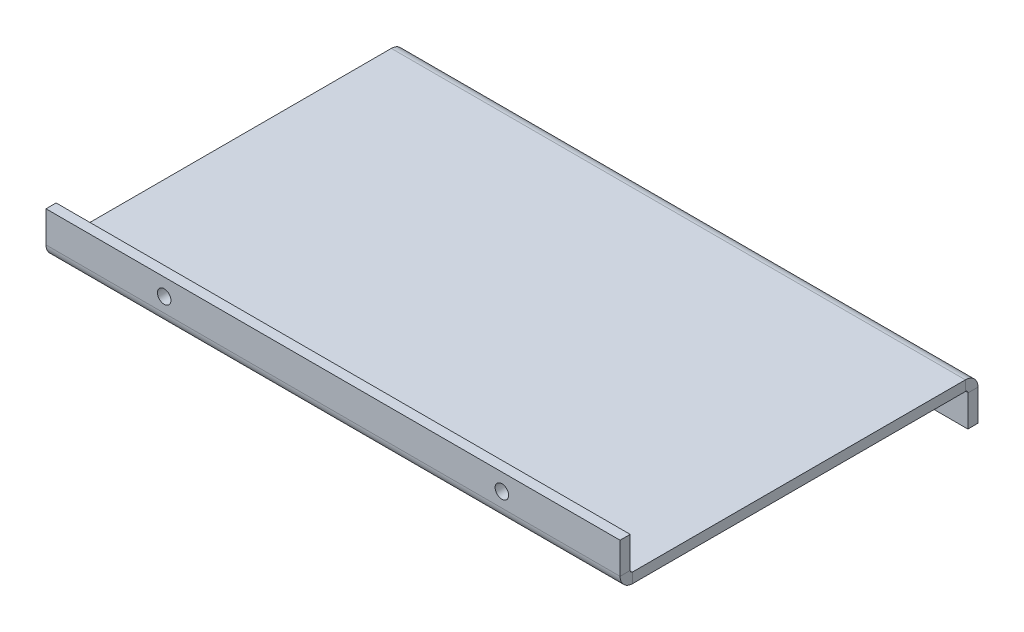
ISO-10303-21;
HEADER;
FILE_DESCRIPTION(('STEP AP214'),'2;1');
FILE_NAME('part.step','',(''),(''),'','','');
FILE_SCHEMA(('AUTOMOTIVE_DESIGN { 1 0 10303 214 1 1 1 1 }'));
ENDSEC;
DATA;
#1=APPLICATION_CONTEXT('core data for automotive mechanical design processes');
#2=APPLICATION_PROTOCOL_DEFINITION('international standard','automotive_design',2000,#1);
#3=PRODUCT_CONTEXT('',#1,'mechanical');
#4=PRODUCT('Part','Part','',(#3));
#5=PRODUCT_RELATED_PRODUCT_CATEGORY('part','',(#4));
#6=PRODUCT_DEFINITION_FORMATION('','',#4);
#7=PRODUCT_DEFINITION_CONTEXT('part definition',#1,'design');
#8=PRODUCT_DEFINITION('design','',#6,#7);
#9=PRODUCT_DEFINITION_SHAPE('','',#8);
#10=(LENGTH_UNIT() NAMED_UNIT(*) SI_UNIT(.MILLI.,.METRE.));
#11=(NAMED_UNIT(*) PLANE_ANGLE_UNIT() SI_UNIT($,.RADIAN.));
#12=(NAMED_UNIT(*) SI_UNIT($,.STERADIAN.) SOLID_ANGLE_UNIT());
#13=UNCERTAINTY_MEASURE_WITH_UNIT(LENGTH_MEASURE(1.E-05),#10,'distance_accuracy_value','');
#14=(GEOMETRIC_REPRESENTATION_CONTEXT(3) GLOBAL_UNCERTAINTY_ASSIGNED_CONTEXT((#13)) GLOBAL_UNIT_ASSIGNED_CONTEXT((#10,
#11,#12)) REPRESENTATION_CONTEXT('',''));
#15=CARTESIAN_POINT('',(0.,0.,0.));
#16=DIRECTION('',(0.,0.,1.));
#17=DIRECTION('',(1.,0.,0.));
#18=AXIS2_PLACEMENT_3D('',#15,#16,#17);
#19=CARTESIAN_POINT('',(85.,-3.,50.));
#20=DIRECTION('',(1.,0.,0.));
#21=DIRECTION('',(0.,0.,-1.));
#22=AXIS2_PLACEMENT_3D('',#19,#20,#21);
#23=PLANE('',#22);
#24=DIRECTION('',(0.,0.,-1.));
#25=VECTOR('',#24,1.);
#26=CARTESIAN_POINT('',(85.,-3.,50.));
#27=LINE('',#26,#25);
#28=CARTESIAN_POINT('',(85.,-3.,49.2634));
#29=VERTEX_POINT('',#28);
#30=CARTESIAN_POINT('',(85.,-3.00000000000001,-49.2634));
#31=VERTEX_POINT('',#30);
#32=EDGE_CURVE('E11',#29,#31,#27,.T.);
#33=ORIENTED_EDGE('',*,*,#32,.T.);
#34=DIRECTION('',(0.,1.,0.));
#35=VECTOR('',#34,1.);
#36=CARTESIAN_POINT('',(85.,-3.00000000000001,-49.2634));
#37=LINE('',#36,#35);
#38=CARTESIAN_POINT('',(85.,0.,-49.2634000000001));
#39=VERTEX_POINT('',#38);
#40=EDGE_CURVE('E201',#31,#39,#37,.T.);
#41=ORIENTED_EDGE('',*,*,#40,.T.);
#42=DIRECTION('',(0.,0.,-1.));
#43=VECTOR('',#42,1.);
#44=CARTESIAN_POINT('',(85.,0.,50.));
#45=LINE('',#44,#43);
#46=CARTESIAN_POINT('',(85.,0.,49.2634));
#47=VERTEX_POINT('',#46);
#48=EDGE_CURVE('E45',#47,#39,#45,.T.);
#49=ORIENTED_EDGE('',*,*,#48,.F.);
#50=DIRECTION('',(0.,-1.,0.));
#51=VECTOR('',#50,1.);
#52=CARTESIAN_POINT('',(85.,0.,49.2634));
#53=LINE('',#52,#51);
#54=EDGE_CURVE('E268',#47,#29,#53,.T.);
#55=ORIENTED_EDGE('',*,*,#54,.T.);
#56=EDGE_LOOP('',(#33,#41,#49,#55));
#57=FACE_BOUND('',#56,.T.);
#58=ADVANCED_FACE('F41',(#57),#23,.T.);
#59=CARTESIAN_POINT('',(0.,-3.,0.));
#60=DIRECTION('',(0.,1.,0.));
#61=DIRECTION('',(0.,0.,1.));
#62=AXIS2_PLACEMENT_3D('',#59,#60,#61);
#63=PLANE('',#62);
#64=DIRECTION('',(1.,0.,0.));
#65=VECTOR('',#64,1.);
#66=CARTESIAN_POINT('',(85.,-3.00000000000001,-49.2634));
#67=LINE('',#66,#65);
#68=CARTESIAN_POINT('',(-85.,-3.00000000000001,-49.2634));
#69=VERTEX_POINT('',#68);
#70=EDGE_CURVE('E206',#31,#69,#67,.F.);
#71=ORIENTED_EDGE('',*,*,#70,.F.);
#72=ORIENTED_EDGE('',*,*,#32,.F.);
#73=DIRECTION('',(1.,0.,0.));
#74=VECTOR('',#73,1.);
#75=CARTESIAN_POINT('',(85.,-3.,49.2634));
#76=LINE('',#75,#74);
#77=CARTESIAN_POINT('',(-84.9999999999999,-3.,49.2634));
#78=VERTEX_POINT('',#77);
#79=EDGE_CURVE('E260',#29,#78,#76,.F.);
#80=ORIENTED_EDGE('',*,*,#79,.T.);
#81=DIRECTION('',(0.,0.,1.));
#82=VECTOR('',#81,1.);
#83=CARTESIAN_POINT('',(-85.,-3.,50.));
#84=LINE('',#83,#82);
#85=EDGE_CURVE('E51',#69,#78,#84,.T.);
#86=ORIENTED_EDGE('',*,*,#85,.F.);
#87=EDGE_LOOP('',(#71,#72,#80,#86));
#88=FACE_BOUND('',#87,.T.);
#89=ADVANCED_FACE('F333',(#88),#63,.F.);
#90=CARTESIAN_POINT('',(0.,0.,0.));
#91=DIRECTION('',(0.,1.,0.));
#92=DIRECTION('',(0.,0.,1.));
#93=AXIS2_PLACEMENT_3D('',#90,#91,#92);
#94=PLANE('',#93);
#95=ORIENTED_EDGE('',*,*,#48,.T.);
#96=DIRECTION('',(1.,0.,0.));
#97=VECTOR('',#96,1.);
#98=CARTESIAN_POINT('',(85.,0.,-49.2634000000001));
#99=LINE('',#98,#97);
#100=CARTESIAN_POINT('',(-85.,0.,-49.2634));
#101=VERTEX_POINT('',#100);
#102=EDGE_CURVE('E141',#39,#101,#99,.F.);
#103=ORIENTED_EDGE('',*,*,#102,.T.);
#104=DIRECTION('',(0.,0.,1.));
#105=VECTOR('',#104,1.);
#106=CARTESIAN_POINT('',(-85.,0.,50.));
#107=LINE('',#106,#105);
#108=CARTESIAN_POINT('',(-84.9999999999999,0.,49.2634));
#109=VERTEX_POINT('',#108);
#110=EDGE_CURVE('E285',#101,#109,#107,.T.);
#111=ORIENTED_EDGE('',*,*,#110,.T.);
#112=DIRECTION('',(1.,0.,0.));
#113=VECTOR('',#112,1.);
#114=CARTESIAN_POINT('',(85.,0.,49.2634));
#115=LINE('',#114,#113);
#116=EDGE_CURVE('E59',#47,#109,#115,.F.);
#117=ORIENTED_EDGE('',*,*,#116,.F.);
#118=EDGE_LOOP('',(#95,#103,#111,#117));
#119=FACE_BOUND('',#118,.T.);
#120=ADVANCED_FACE('F293',(#119),#94,.T.);
#121=CARTESIAN_POINT('',(-85.,-3.,50.));
#122=DIRECTION('',(-1.,0.,0.));
#123=DIRECTION('',(0.,0.,1.));
#124=AXIS2_PLACEMENT_3D('',#121,#122,#123);
#125=PLANE('',#124);
#126=DIRECTION('',(0.,1.,0.));
#127=VECTOR('',#126,1.);
#128=CARTESIAN_POINT('',(-85.,-3.00000000000001,-49.2634));
#129=LINE('',#128,#127);
#130=EDGE_CURVE('E211',#69,#101,#129,.T.);
#131=ORIENTED_EDGE('',*,*,#130,.F.);
#132=ORIENTED_EDGE('',*,*,#85,.T.);
#133=DIRECTION('',(0.,-1.,0.));
#134=VECTOR('',#133,1.);
#135=CARTESIAN_POINT('',(-84.9999999999999,0.,49.2634));
#136=LINE('',#135,#134);
#137=EDGE_CURVE('E281',#109,#78,#136,.T.);
#138=ORIENTED_EDGE('',*,*,#137,.F.);
#139=ORIENTED_EDGE('',*,*,#110,.F.);
#140=EDGE_LOOP('',(#131,#132,#138,#139));
#141=FACE_BOUND('',#140,.T.);
#142=ADVANCED_FACE('F43',(#141),#125,.T.);
#143=CARTESIAN_POINT('',(-85.,0.736599999999993,49.2634));
#144=DIRECTION('',(-1.,0.,0.));
#145=DIRECTION('',(0.,0.,1.));
#146=AXIS2_PLACEMENT_3D('',#143,#144,#145);
#147=PLANE('',#146);
#148=DIRECTION('',(0.,0.,1.));
#149=VECTOR('',#148,1.);
#150=CARTESIAN_POINT('',(-85.,0.736599999999997,50.));
#151=LINE('',#150,#149);
#152=CARTESIAN_POINT('',(-84.9999999999999,0.736599999999993,50.));
#153=VERTEX_POINT('',#152);
#154=CARTESIAN_POINT('',(-84.9999999999999,0.736599999999993,53.));
#155=VERTEX_POINT('',#154);
#156=EDGE_CURVE('E215',#153,#155,#151,.T.);
#157=ORIENTED_EDGE('',*,*,#156,.F.);
#158=CARTESIAN_POINT('',(-85.,0.736599999999993,49.2634));
#159=DIRECTION('',(1.,0.,0.));
#160=DIRECTION('',(0.,0.,-1.));
#161=AXIS2_PLACEMENT_3D('',#158,#159,#160);
#162=CIRCLE('',#161,0.736599999999997);
#163=EDGE_CURVE('E272',#109,#153,#162,.F.);
#164=ORIENTED_EDGE('',*,*,#163,.F.);
#165=ORIENTED_EDGE('',*,*,#137,.T.);
#166=CARTESIAN_POINT('',(-84.9999999999999,0.736599999999993,49.2634));
#167=DIRECTION('',(1.,0.,0.));
#168=DIRECTION('',(0.,0.,-1.));
#169=AXIS2_PLACEMENT_3D('',#166,#167,#168);
#170=CIRCLE('',#169,3.7366);
#171=EDGE_CURVE('E263',#78,#155,#170,.F.);
#172=ORIENTED_EDGE('',*,*,#171,.T.);
#173=EDGE_LOOP('',(#157,#164,#165,#172));
#174=FACE_BOUND('',#173,.T.);
#175=ADVANCED_FACE('F328',(#174),#147,.T.);
#176=CARTESIAN_POINT('',(85.,0.736599999999993,49.2634));
#177=DIRECTION('',(-1.,0.,0.));
#178=DIRECTION('',(0.,0.,1.));
#179=AXIS2_PLACEMENT_3D('',#176,#177,#178);
#180=PLANE('',#179);
#181=CARTESIAN_POINT('',(85.,0.736599999999993,49.2634));
#182=DIRECTION('',(1.,0.,0.));
#183=DIRECTION('',(0.,0.,-1.));
#184=AXIS2_PLACEMENT_3D('',#181,#182,#183);
#185=CIRCLE('',#184,0.736599999999997);
#186=CARTESIAN_POINT('',(85.,0.736599999999993,50.));
#187=VERTEX_POINT('',#186);
#188=EDGE_CURVE('E259',#187,#47,#185,.T.);
#189=ORIENTED_EDGE('',*,*,#188,.F.);
#190=DIRECTION('',(0.,0.,1.));
#191=VECTOR('',#190,1.);
#192=CARTESIAN_POINT('',(85.,0.73659999999999,50.));
#193=LINE('',#192,#191);
#194=CARTESIAN_POINT('',(85.,0.73659999999999,53.));
#195=VERTEX_POINT('',#194);
#196=EDGE_CURVE('E221',#187,#195,#193,.T.);
#197=ORIENTED_EDGE('',*,*,#196,.T.);
#198=CARTESIAN_POINT('',(85.,0.736599999999993,49.2634));
#199=DIRECTION('',(1.,0.,0.));
#200=DIRECTION('',(0.,0.,-1.));
#201=AXIS2_PLACEMENT_3D('',#198,#199,#200);
#202=CIRCLE('',#201,3.7366);
#203=EDGE_CURVE('E264',#195,#29,#202,.T.);
#204=ORIENTED_EDGE('',*,*,#203,.T.);
#205=ORIENTED_EDGE('',*,*,#54,.F.);
#206=EDGE_LOOP('',(#189,#197,#204,#205));
#207=FACE_BOUND('',#206,.T.);
#208=ADVANCED_FACE('F299',(#207),#180,.F.);
#209=CARTESIAN_POINT('',(85.,0.736599999999993,49.2634));
#210=DIRECTION('',(1.,0.,0.));
#211=DIRECTION('',(0.,0.,1.));
#212=AXIS2_PLACEMENT_3D('',#209,#210,#211);
#213=CYLINDRICAL_SURFACE('',#212,3.7366);
#214=ORIENTED_EDGE('',*,*,#79,.F.);
#215=ORIENTED_EDGE('',*,*,#203,.F.);
#216=DIRECTION('',(-1.,0.,0.));
#217=VECTOR('',#216,1.);
#218=CARTESIAN_POINT('',(0.,0.736599999999993,53.));
#219=LINE('',#218,#217);
#220=EDGE_CURVE('E225',#195,#155,#219,.T.);
#221=ORIENTED_EDGE('',*,*,#220,.T.);
#222=ORIENTED_EDGE('',*,*,#171,.F.);
#223=EDGE_LOOP('',(#214,#215,#221,#222));
#224=FACE_BOUND('',#223,.T.);
#225=ADVANCED_FACE('F326',(#224),#213,.T.);
#226=CARTESIAN_POINT('',(85.,0.736599999999993,49.2634));
#227=DIRECTION('',(1.,0.,0.));
#228=DIRECTION('',(0.,0.,1.));
#229=AXIS2_PLACEMENT_3D('',#226,#227,#228);
#230=CYLINDRICAL_SURFACE('',#229,0.736599999999997);
#231=ORIENTED_EDGE('',*,*,#116,.T.);
#232=ORIENTED_EDGE('',*,*,#163,.T.);
#233=DIRECTION('',(1.,0.,0.));
#234=VECTOR('',#233,1.);
#235=CARTESIAN_POINT('',(-85.,0.736599999999997,50.));
#236=LINE('',#235,#234);
#237=EDGE_CURVE('E218',#153,#187,#236,.T.);
#238=ORIENTED_EDGE('',*,*,#237,.T.);
#239=ORIENTED_EDGE('',*,*,#188,.T.);
#240=EDGE_LOOP('',(#231,#232,#238,#239));
#241=FACE_BOUND('',#240,.T.);
#242=ADVANCED_FACE('F302',(#241),#230,.F.);
#243=CARTESIAN_POINT('',(-85.,0.,53.));
#244=DIRECTION('',(1.,0.,0.));
#245=DIRECTION('',(0.,1.,0.));
#246=AXIS2_PLACEMENT_3D('',#243,#244,#245);
#247=PLANE('',#246);
#248=ORIENTED_EDGE('',*,*,#156,.T.);
#249=DIRECTION('',(0.,-1.,0.));
#250=VECTOR('',#249,1.);
#251=CARTESIAN_POINT('',(-85.,0.,53.));
#252=LINE('',#251,#250);
#253=CARTESIAN_POINT('',(-85.,10.,53.));
#254=VERTEX_POINT('',#253);
#255=EDGE_CURVE('E232',#254,#155,#252,.T.);
#256=ORIENTED_EDGE('',*,*,#255,.F.);
#257=DIRECTION('',(0.,0.,-1.));
#258=VECTOR('',#257,1.);
#259=CARTESIAN_POINT('',(-85.,10.,53.));
#260=LINE('',#259,#258);
#261=CARTESIAN_POINT('',(-85.,10.,50.));
#262=VERTEX_POINT('',#261);
#263=EDGE_CURVE('E243',#254,#262,#260,.T.);
#264=ORIENTED_EDGE('',*,*,#263,.T.);
#265=DIRECTION('',(0.,-1.,0.));
#266=VECTOR('',#265,1.);
#267=CARTESIAN_POINT('',(-85.,0.,50.));
#268=LINE('',#267,#266);
#269=EDGE_CURVE('E231',#262,#153,#268,.T.);
#270=ORIENTED_EDGE('',*,*,#269,.T.);
#271=EDGE_LOOP('',(#248,#256,#264,#270));
#272=FACE_BOUND('',#271,.T.);
#273=ADVANCED_FACE('F311',(#272),#247,.F.);
#274=CARTESIAN_POINT('',(85.,10.,53.));
#275=DIRECTION('',(-1.,0.,0.));
#276=DIRECTION('',(0.,-1.,0.));
#277=AXIS2_PLACEMENT_3D('',#274,#275,#276);
#278=PLANE('',#277);
#279=ORIENTED_EDGE('',*,*,#196,.F.);
#280=DIRECTION('',(0.,1.,0.));
#281=VECTOR('',#280,1.);
#282=CARTESIAN_POINT('',(85.,10.,50.));
#283=LINE('',#282,#281);
#284=CARTESIAN_POINT('',(85.,10.,50.));
#285=VERTEX_POINT('',#284);
#286=EDGE_CURVE('E247',#187,#285,#283,.T.);
#287=ORIENTED_EDGE('',*,*,#286,.T.);
#288=DIRECTION('',(0.,0.,-1.));
#289=VECTOR('',#288,1.);
#290=CARTESIAN_POINT('',(85.,10.,53.));
#291=LINE('',#290,#289);
#292=CARTESIAN_POINT('',(85.,10.,53.));
#293=VERTEX_POINT('',#292);
#294=EDGE_CURVE('E255',#293,#285,#291,.T.);
#295=ORIENTED_EDGE('',*,*,#294,.F.);
#296=DIRECTION('',(0.,1.,0.));
#297=VECTOR('',#296,1.);
#298=CARTESIAN_POINT('',(85.,10.,53.));
#299=LINE('',#298,#297);
#300=EDGE_CURVE('E236',#195,#293,#299,.T.);
#301=ORIENTED_EDGE('',*,*,#300,.F.);
#302=EDGE_LOOP('',(#279,#287,#295,#301));
#303=FACE_BOUND('',#302,.T.);
#304=ADVANCED_FACE('F320',(#303),#278,.F.);
#305=CARTESIAN_POINT('',(0.,0.,53.));
#306=DIRECTION('',(0.,0.,-1.));
#307=DIRECTION('',(-1.,0.,0.));
#308=AXIS2_PLACEMENT_3D('',#305,#306,#307);
#309=PLANE('',#308);
#310=CARTESIAN_POINT('',(-50.,5.00000000000001,53.));
#311=DIRECTION('',(0.,0.,1.));
#312=DIRECTION('',(1.,0.,0.));
#313=AXIS2_PLACEMENT_3D('',#310,#311,#312);
#314=CIRCLE('',#313,2.);
#315=CARTESIAN_POINT('',(-48.,5.00000000000001,53.));
#316=VERTEX_POINT('',#315);
#317=EDGE_CURVE('E342',#316,#316,#314,.T.);
#318=ORIENTED_EDGE('',*,*,#317,.F.);
#319=EDGE_LOOP('',(#318));
#320=FACE_BOUND('',#319,.T.);
#321=CARTESIAN_POINT('',(50.,5.00000000000002,53.));
#322=DIRECTION('',(0.,0.,1.));
#323=DIRECTION('',(-1.,0.,0.));
#324=AXIS2_PLACEMENT_3D('',#321,#322,#323);
#325=CIRCLE('',#324,2.);
#326=CARTESIAN_POINT('',(48.,5.00000000000002,53.));
#327=VERTEX_POINT('',#326);
#328=EDGE_CURVE('E354',#327,#327,#325,.T.);
#329=ORIENTED_EDGE('',*,*,#328,.F.);
#330=EDGE_LOOP('',(#329));
#331=FACE_BOUND('',#330,.T.);
#332=ORIENTED_EDGE('',*,*,#220,.F.);
#333=ORIENTED_EDGE('',*,*,#300,.T.);
#334=DIRECTION('',(-1.,0.,0.));
#335=VECTOR('',#334,1.);
#336=CARTESIAN_POINT('',(-85.,10.,53.));
#337=LINE('',#336,#335);
#338=EDGE_CURVE('E240',#293,#254,#337,.T.);
#339=ORIENTED_EDGE('',*,*,#338,.T.);
#340=ORIENTED_EDGE('',*,*,#255,.T.);
#341=EDGE_LOOP('',(#332,#333,#339,#340));
#342=FACE_BOUND('',#341,.T.);
#343=ADVANCED_FACE('F323',(#320,#331,#342),#309,.F.);
#344=CARTESIAN_POINT('',(0.,0.,50.));
#345=DIRECTION('',(0.,0.,-1.));
#346=DIRECTION('',(-1.,0.,0.));
#347=AXIS2_PLACEMENT_3D('',#344,#345,#346);
#348=PLANE('',#347);
#349=CARTESIAN_POINT('',(-50.,5.00000000000001,50.));
#350=DIRECTION('',(0.,0.,-1.));
#351=DIRECTION('',(-1.,0.,0.));
#352=AXIS2_PLACEMENT_3D('',#349,#350,#351);
#353=CIRCLE('',#352,2.);
#354=CARTESIAN_POINT('',(-52.,5.00000000000001,50.));
#355=VERTEX_POINT('',#354);
#356=EDGE_CURVE('E347',#355,#355,#353,.F.);
#357=ORIENTED_EDGE('',*,*,#356,.T.);
#358=EDGE_LOOP('',(#357));
#359=FACE_BOUND('',#358,.T.);
#360=CARTESIAN_POINT('',(50.,5.00000000000002,50.));
#361=DIRECTION('',(0.,0.,-1.));
#362=DIRECTION('',(-1.,0.,0.));
#363=AXIS2_PLACEMENT_3D('',#360,#361,#362);
#364=CIRCLE('',#363,2.);
#365=CARTESIAN_POINT('',(48.,5.00000000000002,50.));
#366=VERTEX_POINT('',#365);
#367=EDGE_CURVE('E350',#366,#366,#364,.F.);
#368=ORIENTED_EDGE('',*,*,#367,.T.);
#369=EDGE_LOOP('',(#368));
#370=FACE_BOUND('',#369,.T.);
#371=ORIENTED_EDGE('',*,*,#286,.F.);
#372=ORIENTED_EDGE('',*,*,#237,.F.);
#373=ORIENTED_EDGE('',*,*,#269,.F.);
#374=DIRECTION('',(-1.,0.,0.));
#375=VECTOR('',#374,1.);
#376=CARTESIAN_POINT('',(-85.,10.,50.));
#377=LINE('',#376,#375);
#378=EDGE_CURVE('E237',#285,#262,#377,.T.);
#379=ORIENTED_EDGE('',*,*,#378,.F.);
#380=EDGE_LOOP('',(#371,#372,#373,#379));
#381=FACE_BOUND('',#380,.T.);
#382=ADVANCED_FACE('F308',(#359,#370,#381),#348,.T.);
#383=CARTESIAN_POINT('',(-85.,10.,53.));
#384=DIRECTION('',(0.,-1.,0.));
#385=DIRECTION('',(0.,0.,-1.));
#386=AXIS2_PLACEMENT_3D('',#383,#384,#385);
#387=PLANE('',#386);
#388=ORIENTED_EDGE('',*,*,#378,.T.);
#389=ORIENTED_EDGE('',*,*,#263,.F.);
#390=ORIENTED_EDGE('',*,*,#338,.F.);
#391=ORIENTED_EDGE('',*,*,#294,.T.);
#392=EDGE_LOOP('',(#388,#389,#390,#391));
#393=FACE_BOUND('',#392,.T.);
#394=ADVANCED_FACE('F316',(#393),#387,.F.);
#395=CARTESIAN_POINT('',(-85.,-3.7366,-49.2634));
#396=DIRECTION('',(-1.,0.,0.));
#397=DIRECTION('',(0.,0.,1.));
#398=AXIS2_PLACEMENT_3D('',#395,#396,#397);
#399=PLANE('',#398);
#400=DIRECTION('',(0.,0.,-1.));
#401=VECTOR('',#400,1.);
#402=CARTESIAN_POINT('',(-85.,-3.7366,-50.));
#403=LINE('',#402,#401);
#404=CARTESIAN_POINT('',(-85.,-3.73659999999999,-50.));
#405=VERTEX_POINT('',#404);
#406=CARTESIAN_POINT('',(-85.,-3.73659999999998,-53.));
#407=VERTEX_POINT('',#406);
#408=EDGE_CURVE('E339',#405,#407,#403,.T.);
#409=ORIENTED_EDGE('',*,*,#408,.F.);
#410=CARTESIAN_POINT('',(-85.,-3.7366,-49.2634));
#411=DIRECTION('',(1.,0.,0.));
#412=DIRECTION('',(0.,0.,-1.));
#413=AXIS2_PLACEMENT_3D('',#410,#411,#412);
#414=CIRCLE('',#413,0.73659999999999);
#415=EDGE_CURVE('E145',#69,#405,#414,.F.);
#416=ORIENTED_EDGE('',*,*,#415,.F.);
#417=ORIENTED_EDGE('',*,*,#130,.T.);
#418=CARTESIAN_POINT('',(-85.,-3.7366,-49.2634));
#419=DIRECTION('',(1.,0.,0.));
#420=DIRECTION('',(0.,0.,-1.));
#421=AXIS2_PLACEMENT_3D('',#418,#419,#420);
#422=CIRCLE('',#421,3.73659999999999);
#423=EDGE_CURVE('E199',#101,#407,#422,.F.);
#424=ORIENTED_EDGE('',*,*,#423,.T.);
#425=EDGE_LOOP('',(#409,#416,#417,#424));
#426=FACE_BOUND('',#425,.T.);
#427=ADVANCED_FACE('F337',(#426),#399,.T.);
#428=CARTESIAN_POINT('',(85.,-3.7366,-49.2634));
#429=DIRECTION('',(-1.,0.,0.));
#430=DIRECTION('',(0.,0.,1.));
#431=AXIS2_PLACEMENT_3D('',#428,#429,#430);
#432=PLANE('',#431);
#433=CARTESIAN_POINT('',(85.,-3.7366,-49.2634));
#434=DIRECTION('',(1.,0.,0.));
#435=DIRECTION('',(0.,0.,-1.));
#436=AXIS2_PLACEMENT_3D('',#433,#434,#435);
#437=CIRCLE('',#436,0.73659999999999);
#438=CARTESIAN_POINT('',(85.,-3.73659999999999,-50.));
#439=VERTEX_POINT('',#438);
#440=EDGE_CURVE('E152',#439,#31,#437,.T.);
#441=ORIENTED_EDGE('',*,*,#440,.F.);
#442=DIRECTION('',(0.,0.,-1.));
#443=VECTOR('',#442,1.);
#444=CARTESIAN_POINT('',(85.,-3.73659999999999,-50.));
#445=LINE('',#444,#443);
#446=CARTESIAN_POINT('',(85.,-3.73659999999997,-53.));
#447=VERTEX_POINT('',#446);
#448=EDGE_CURVE('E149',#439,#447,#445,.T.);
#449=ORIENTED_EDGE('',*,*,#448,.T.);
#450=CARTESIAN_POINT('',(85.,-3.7366,-49.2634));
#451=DIRECTION('',(1.,0.,0.));
#452=DIRECTION('',(0.,0.,-1.));
#453=AXIS2_PLACEMENT_3D('',#450,#451,#452);
#454=CIRCLE('',#453,3.73659999999999);
#455=EDGE_CURVE('E134',#447,#39,#454,.T.);
#456=ORIENTED_EDGE('',*,*,#455,.T.);
#457=ORIENTED_EDGE('',*,*,#40,.F.);
#458=EDGE_LOOP('',(#441,#449,#456,#457));
#459=FACE_BOUND('',#458,.T.);
#460=ADVANCED_FACE('F150',(#459),#432,.F.);
#461=CARTESIAN_POINT('',(85.,-3.7366,-49.2634));
#462=DIRECTION('',(1.,0.,0.));
#463=DIRECTION('',(0.,0.,-1.));
#464=AXIS2_PLACEMENT_3D('',#461,#462,#463);
#465=CYLINDRICAL_SURFACE('',#464,3.73659999999999);
#466=ORIENTED_EDGE('',*,*,#102,.F.);
#467=ORIENTED_EDGE('',*,*,#455,.F.);
#468=DIRECTION('',(-1.,0.,0.));
#469=VECTOR('',#468,1.);
#470=CARTESIAN_POINT('',(0.,-3.73659999999997,-53.));
#471=LINE('',#470,#469);
#472=EDGE_CURVE('E138',#447,#407,#471,.T.);
#473=ORIENTED_EDGE('',*,*,#472,.T.);
#474=ORIENTED_EDGE('',*,*,#423,.F.);
#475=EDGE_LOOP('',(#466,#467,#473,#474));
#476=FACE_BOUND('',#475,.T.);
#477=ADVANCED_FACE('F136',(#476),#465,.T.);
#478=CARTESIAN_POINT('',(85.,-3.7366,-49.2634));
#479=DIRECTION('',(1.,0.,0.));
#480=DIRECTION('',(0.,0.,-1.));
#481=AXIS2_PLACEMENT_3D('',#478,#479,#480);
#482=CYLINDRICAL_SURFACE('',#481,0.73659999999999);
#483=ORIENTED_EDGE('',*,*,#70,.T.);
#484=ORIENTED_EDGE('',*,*,#415,.T.);
#485=DIRECTION('',(1.,0.,0.));
#486=VECTOR('',#485,1.);
#487=CARTESIAN_POINT('',(-85.,-3.7366,-50.));
#488=LINE('',#487,#486);
#489=EDGE_CURVE('E157',#405,#439,#488,.T.);
#490=ORIENTED_EDGE('',*,*,#489,.T.);
#491=ORIENTED_EDGE('',*,*,#440,.T.);
#492=EDGE_LOOP('',(#483,#484,#490,#491));
#493=FACE_BOUND('',#492,.T.);
#494=ADVANCED_FACE('F335',(#493),#482,.F.);
#495=CARTESIAN_POINT('',(85.,-13.,-53.0000000000001));
#496=DIRECTION('',(-1.,0.,0.));
#497=DIRECTION('',(0.,-1.,0.));
#498=AXIS2_PLACEMENT_3D('',#495,#496,#497);
#499=PLANE('',#498);
#500=ORIENTED_EDGE('',*,*,#448,.F.);
#501=DIRECTION('',(0.,-1.,0.));
#502=VECTOR('',#501,1.);
#503=CARTESIAN_POINT('',(85.,-13.,-50.0000000000001));
#504=LINE('',#503,#502);
#505=CARTESIAN_POINT('',(85.,-13.,-50.0000000000001));
#506=VERTEX_POINT('',#505);
#507=EDGE_CURVE('E167',#439,#506,#504,.T.);
#508=ORIENTED_EDGE('',*,*,#507,.T.);
#509=DIRECTION('',(0.,0.,1.));
#510=VECTOR('',#509,1.);
#511=CARTESIAN_POINT('',(85.,-13.,-53.0000000000001));
#512=LINE('',#511,#510);
#513=CARTESIAN_POINT('',(85.,-13.,-53.0000000000001));
#514=VERTEX_POINT('',#513);
#515=EDGE_CURVE('E172',#514,#506,#512,.T.);
#516=ORIENTED_EDGE('',*,*,#515,.F.);
#517=DIRECTION('',(0.,-1.,0.));
#518=VECTOR('',#517,1.);
#519=CARTESIAN_POINT('',(85.,-13.,-53.0000000000001));
#520=LINE('',#519,#518);
#521=EDGE_CURVE('E162',#447,#514,#520,.T.);
#522=ORIENTED_EDGE('',*,*,#521,.F.);
#523=EDGE_LOOP('',(#500,#508,#516,#522));
#524=FACE_BOUND('',#523,.T.);
#525=ADVANCED_FACE('F170',(#524),#499,.F.);
#526=CARTESIAN_POINT('',(-85.,-2.99999999999999,-53.));
#527=DIRECTION('',(1.,0.,0.));
#528=DIRECTION('',(0.,1.,0.));
#529=AXIS2_PLACEMENT_3D('',#526,#527,#528);
#530=PLANE('',#529);
#531=ORIENTED_EDGE('',*,*,#408,.T.);
#532=DIRECTION('',(0.,1.,0.));
#533=VECTOR('',#532,1.);
#534=CARTESIAN_POINT('',(-85.,-2.99999999999999,-53.));
#535=LINE('',#534,#533);
#536=CARTESIAN_POINT('',(-85.,-13.,-53.));
#537=VERTEX_POINT('',#536);
#538=EDGE_CURVE('E165',#537,#407,#535,.T.);
#539=ORIENTED_EDGE('',*,*,#538,.F.);
#540=DIRECTION('',(0.,0.,1.));
#541=VECTOR('',#540,1.);
#542=CARTESIAN_POINT('',(-85.,-13.,-53.));
#543=LINE('',#542,#541);
#544=CARTESIAN_POINT('',(-85.,-13.,-50.));
#545=VERTEX_POINT('',#544);
#546=EDGE_CURVE('E187',#537,#545,#543,.T.);
#547=ORIENTED_EDGE('',*,*,#546,.T.);
#548=DIRECTION('',(0.,1.,0.));
#549=VECTOR('',#548,1.);
#550=CARTESIAN_POINT('',(-85.,-3.,-50.));
#551=LINE('',#550,#549);
#552=EDGE_CURVE('E175',#545,#405,#551,.T.);
#553=ORIENTED_EDGE('',*,*,#552,.T.);
#554=EDGE_LOOP('',(#531,#539,#547,#553));
#555=FACE_BOUND('',#554,.T.);
#556=ADVANCED_FACE('F383',(#555),#530,.F.);
#557=CARTESIAN_POINT('',(0.,2.18641261133746E-13,-53.));
#558=DIRECTION('',(0.,0.,1.));
#559=DIRECTION('',(0.,-1.,0.));
#560=AXIS2_PLACEMENT_3D('',#557,#558,#559);
#561=PLANE('',#560);
#562=CARTESIAN_POINT('',(50.,-7.99999999999999,-53.));
#563=DIRECTION('',(0.,0.,-1.));
#564=DIRECTION('',(0.,1.,0.));
#565=AXIS2_PLACEMENT_3D('',#562,#563,#564);
#566=CIRCLE('',#565,2.);
#567=CARTESIAN_POINT('',(50.,-5.99999999999999,-53.));
#568=VERTEX_POINT('',#567);
#569=EDGE_CURVE('E355',#568,#568,#566,.T.);
#570=ORIENTED_EDGE('',*,*,#569,.F.);
#571=EDGE_LOOP('',(#570));
#572=FACE_BOUND('',#571,.T.);
#573=CARTESIAN_POINT('',(-50.,-7.99999999999998,-53.));
#574=DIRECTION('',(0.,0.,-1.));
#575=DIRECTION('',(0.,-1.,0.));
#576=AXIS2_PLACEMENT_3D('',#573,#574,#575);
#577=CIRCLE('',#576,2.);
#578=CARTESIAN_POINT('',(-50.,-9.99999999999998,-53.));
#579=VERTEX_POINT('',#578);
#580=EDGE_CURVE('E366',#579,#579,#577,.T.);
#581=ORIENTED_EDGE('',*,*,#580,.F.);
#582=EDGE_LOOP('',(#581));
#583=FACE_BOUND('',#582,.T.);
#584=ORIENTED_EDGE('',*,*,#472,.F.);
#585=ORIENTED_EDGE('',*,*,#521,.T.);
#586=DIRECTION('',(-1.,0.,0.));
#587=VECTOR('',#586,1.);
#588=CARTESIAN_POINT('',(-85.,-13.,-53.));
#589=LINE('',#588,#587);
#590=EDGE_CURVE('E174',#514,#537,#589,.T.);
#591=ORIENTED_EDGE('',*,*,#590,.T.);
#592=ORIENTED_EDGE('',*,*,#538,.T.);
#593=EDGE_LOOP('',(#584,#585,#591,#592));
#594=FACE_BOUND('',#593,.T.);
#595=ADVANCED_FACE('F161',(#572,#583,#594),#561,.F.);
#596=CARTESIAN_POINT('',(0.,2.08166817117217E-13,-50.));
#597=DIRECTION('',(0.,0.,1.));
#598=DIRECTION('',(0.,-1.,0.));
#599=AXIS2_PLACEMENT_3D('',#596,#597,#598);
#600=PLANE('',#599);
#601=CARTESIAN_POINT('',(50.,-8.,-50.));
#602=DIRECTION('',(0.,0.,1.));
#603=DIRECTION('',(0.,-1.,0.));
#604=AXIS2_PLACEMENT_3D('',#601,#602,#603);
#605=CIRCLE('',#604,2.);
#606=CARTESIAN_POINT('',(50.,-10.,-50.));
#607=VERTEX_POINT('',#606);
#608=EDGE_CURVE('E370',#607,#607,#605,.F.);
#609=ORIENTED_EDGE('',*,*,#608,.T.);
#610=EDGE_LOOP('',(#609));
#611=FACE_BOUND('',#610,.T.);
#612=CARTESIAN_POINT('',(-50.,-7.99999999999999,-50.));
#613=DIRECTION('',(0.,0.,1.));
#614=DIRECTION('',(0.,-1.,0.));
#615=AXIS2_PLACEMENT_3D('',#612,#613,#614);
#616=CIRCLE('',#615,2.);
#617=CARTESIAN_POINT('',(-50.,-9.99999999999999,-50.));
#618=VERTEX_POINT('',#617);
#619=EDGE_CURVE('E362',#618,#618,#616,.F.);
#620=ORIENTED_EDGE('',*,*,#619,.T.);
#621=EDGE_LOOP('',(#620));
#622=FACE_BOUND('',#621,.T.);
#623=ORIENTED_EDGE('',*,*,#507,.F.);
#624=ORIENTED_EDGE('',*,*,#489,.F.);
#625=ORIENTED_EDGE('',*,*,#552,.F.);
#626=DIRECTION('',(-1.,0.,0.));
#627=VECTOR('',#626,1.);
#628=CARTESIAN_POINT('',(-85.,-13.,-50.));
#629=LINE('',#628,#627);
#630=EDGE_CURVE('E181',#506,#545,#629,.T.);
#631=ORIENTED_EDGE('',*,*,#630,.F.);
#632=EDGE_LOOP('',(#623,#624,#625,#631));
#633=FACE_BOUND('',#632,.T.);
#634=ADVANCED_FACE('F382',(#611,#622,#633),#600,.T.);
#635=CARTESIAN_POINT('',(-85.,-13.,-53.));
#636=DIRECTION('',(0.,1.,0.));
#637=DIRECTION('',(0.,0.,1.));
#638=AXIS2_PLACEMENT_3D('',#635,#636,#637);
#639=PLANE('',#638);
#640=ORIENTED_EDGE('',*,*,#630,.T.);
#641=ORIENTED_EDGE('',*,*,#546,.F.);
#642=ORIENTED_EDGE('',*,*,#590,.F.);
#643=ORIENTED_EDGE('',*,*,#515,.T.);
#644=EDGE_LOOP('',(#640,#641,#642,#643));
#645=FACE_BOUND('',#644,.T.);
#646=ADVANCED_FACE('F440',(#645),#639,.F.);
#647=CARTESIAN_POINT('',(50.,5.00000000000002,-53.0010000000001));
#648=DIRECTION('',(0.,0.,1.));
#649=DIRECTION('',(1.,0.,0.));
#650=AXIS2_PLACEMENT_3D('',#647,#648,#649);
#651=CYLINDRICAL_SURFACE('',#650,2.);
#652=ORIENTED_EDGE('',*,*,#367,.F.);
#653=EDGE_LOOP('',(#652));
#654=FACE_BOUND('',#653,.T.);
#655=ORIENTED_EDGE('',*,*,#328,.T.);
#656=EDGE_LOOP('',(#655));
#657=FACE_BOUND('',#656,.T.);
#658=ADVANCED_FACE('F398',(#654,#657),#651,.F.);
#659=CARTESIAN_POINT('',(-50.,5.00000000000001,-53.0010000000001));
#660=DIRECTION('',(0.,0.,1.));
#661=DIRECTION('',(1.,0.,0.));
#662=AXIS2_PLACEMENT_3D('',#659,#660,#661);
#663=CYLINDRICAL_SURFACE('',#662,2.);
#664=ORIENTED_EDGE('',*,*,#356,.F.);
#665=EDGE_LOOP('',(#664));
#666=FACE_BOUND('',#665,.T.);
#667=ORIENTED_EDGE('',*,*,#317,.T.);
#668=EDGE_LOOP('',(#667));
#669=FACE_BOUND('',#668,.T.);
#670=ADVANCED_FACE('F389',(#666,#669),#663,.F.);
#671=CARTESIAN_POINT('',(-50.,-8.00000000000042,53.001));
#672=DIRECTION('',(0.,0.,-1.));
#673=DIRECTION('',(0.,1.,0.));
#674=AXIS2_PLACEMENT_3D('',#671,#672,#673);
#675=CYLINDRICAL_SURFACE('',#674,2.);
#676=ORIENTED_EDGE('',*,*,#619,.F.);
#677=EDGE_LOOP('',(#676));
#678=FACE_BOUND('',#677,.T.);
#679=ORIENTED_EDGE('',*,*,#580,.T.);
#680=EDGE_LOOP('',(#679));
#681=FACE_BOUND('',#680,.T.);
#682=ADVANCED_FACE('F387',(#678,#681),#675,.F.);
#683=CARTESIAN_POINT('',(50.,-8.00000000000043,53.001));
#684=DIRECTION('',(0.,0.,-1.));
#685=DIRECTION('',(0.,1.,0.));
#686=AXIS2_PLACEMENT_3D('',#683,#684,#685);
#687=CYLINDRICAL_SURFACE('',#686,2.);
#688=ORIENTED_EDGE('',*,*,#608,.F.);
#689=EDGE_LOOP('',(#688));
#690=FACE_BOUND('',#689,.T.);
#691=ORIENTED_EDGE('',*,*,#569,.T.);
#692=EDGE_LOOP('',(#691));
#693=FACE_BOUND('',#692,.T.);
#694=ADVANCED_FACE('F378',(#690,#693),#687,.F.);
#695=CLOSED_SHELL('',(#58,#89,#120,#142,#175,#208,#225,#242,#273,#304,#343,#382,#394,#427,#460,
#477,#494,#525,#556,#595,#634,#646,#658,#670,#682,#694));
#696=MANIFOLD_SOLID_BREP('B2',#695);
#697=ADVANCED_BREP_SHAPE_REPRESENTATION('',(#18,#696),#14);
#698=SHAPE_DEFINITION_REPRESENTATION(#9,#697);
ENDSEC;
END-ISO-10303-21;
